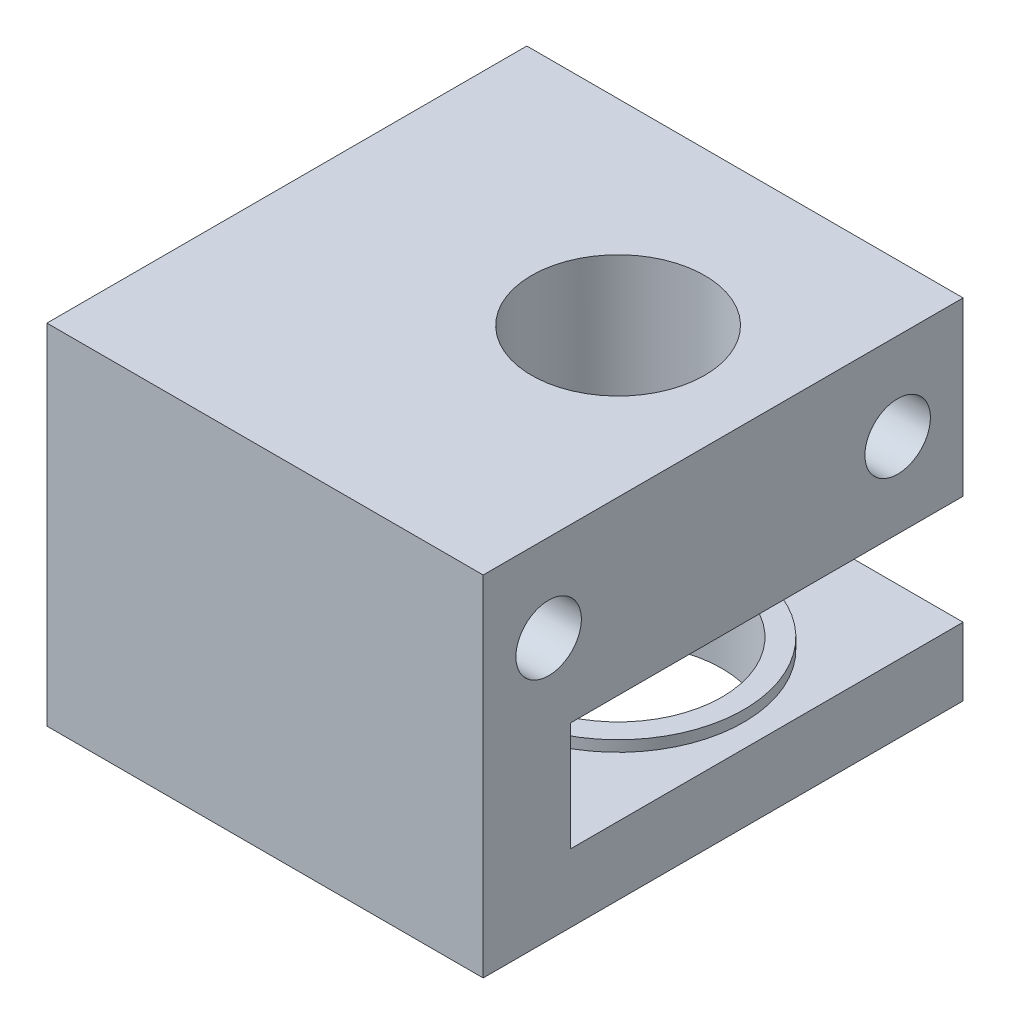
ISO-10303-21;
HEADER;
FILE_DESCRIPTION(('STEP AP214'),'2;1');
FILE_NAME('part.step','',(''),(''),'','','');
FILE_SCHEMA(('AUTOMOTIVE_DESIGN { 1 0 10303 214 1 1 1 1 }'));
ENDSEC;
DATA;
#1=APPLICATION_CONTEXT('core data for automotive mechanical design processes');
#2=APPLICATION_PROTOCOL_DEFINITION('international standard','automotive_design',2000,#1);
#3=PRODUCT_CONTEXT('',#1,'mechanical');
#4=PRODUCT('Part','Part','',(#3));
#5=PRODUCT_RELATED_PRODUCT_CATEGORY('part','',(#4));
#6=PRODUCT_DEFINITION_FORMATION('','',#4);
#7=PRODUCT_DEFINITION_CONTEXT('part definition',#1,'design');
#8=PRODUCT_DEFINITION('design','',#6,#7);
#9=PRODUCT_DEFINITION_SHAPE('','',#8);
#10=(LENGTH_UNIT() NAMED_UNIT(*) SI_UNIT(.MILLI.,.METRE.));
#11=(NAMED_UNIT(*) PLANE_ANGLE_UNIT() SI_UNIT($,.RADIAN.));
#12=(NAMED_UNIT(*) SI_UNIT($,.STERADIAN.) SOLID_ANGLE_UNIT());
#13=UNCERTAINTY_MEASURE_WITH_UNIT(LENGTH_MEASURE(1.E-05),#10,'distance_accuracy_value','');
#14=(GEOMETRIC_REPRESENTATION_CONTEXT(3) GLOBAL_UNCERTAINTY_ASSIGNED_CONTEXT((#13)) GLOBAL_UNIT_ASSIGNED_CONTEXT((#10,
#11,#12)) REPRESENTATION_CONTEXT('',''));
#15=CARTESIAN_POINT('',(0.,0.,0.));
#16=DIRECTION('',(0.,0.,1.));
#17=DIRECTION('',(1.,0.,0.));
#18=AXIS2_PLACEMENT_3D('',#15,#16,#17);
#19=CARTESIAN_POINT('',(20.,8.125,0.));
#20=DIRECTION('',(0.,1.,0.));
#21=DIRECTION('',(0.,0.,1.));
#22=AXIS2_PLACEMENT_3D('',#19,#20,#21);
#23=PLANE('',#22);
#24=CARTESIAN_POINT('',(13.1844941743299,8.125,-13.));
#25=DIRECTION('',(0.,1.,0.));
#26=DIRECTION('',(0.,0.,1.));
#27=AXIS2_PLACEMENT_3D('',#24,#25,#26);
#28=CIRCLE('',#27,5.2625);
#29=CARTESIAN_POINT('',(13.1844941743299,8.125,-7.7375));
#30=VERTEX_POINT('',#29);
#31=EDGE_CURVE('E48',#30,#30,#28,.F.);
#32=ORIENTED_EDGE('',*,*,#31,.F.);
#33=EDGE_LOOP('',(#32));
#34=FACE_BOUND('',#33,.T.);
#35=DIRECTION('',(1.,0.,0.));
#36=VECTOR('',#35,1.);
#37=CARTESIAN_POINT('',(20.,8.125,-4.));
#38=LINE('',#37,#36);
#39=CARTESIAN_POINT('',(5.,8.125,-4.));
#40=VERTEX_POINT('',#39);
#41=CARTESIAN_POINT('',(20.,8.125,-4.));
#42=VERTEX_POINT('',#41);
#43=EDGE_CURVE('E114',#40,#42,#38,.T.);
#44=ORIENTED_EDGE('',*,*,#43,.F.);
#45=DIRECTION('',(0.,0.,-1.));
#46=VECTOR('',#45,1.);
#47=CARTESIAN_POINT('',(5.,8.125,0.));
#48=LINE('',#47,#46);
#49=CARTESIAN_POINT('',(5.,8.125,-22.));
#50=VERTEX_POINT('',#49);
#51=EDGE_CURVE('E106',#40,#50,#48,.T.);
#52=ORIENTED_EDGE('',*,*,#51,.T.);
#53=DIRECTION('',(1.,0.,0.));
#54=VECTOR('',#53,1.);
#55=CARTESIAN_POINT('',(20.,8.125,-22.));
#56=LINE('',#55,#54);
#57=CARTESIAN_POINT('',(20.,8.125,-22.));
#58=VERTEX_POINT('',#57);
#59=EDGE_CURVE('E165',#50,#58,#56,.T.);
#60=ORIENTED_EDGE('',*,*,#59,.T.);
#61=DIRECTION('',(0.,0.,-1.));
#62=VECTOR('',#61,1.);
#63=CARTESIAN_POINT('',(20.,8.125,0.));
#64=LINE('',#63,#62);
#65=EDGE_CURVE('E55',#42,#58,#64,.T.);
#66=ORIENTED_EDGE('',*,*,#65,.F.);
#67=EDGE_LOOP('',(#44,#52,#60,#66));
#68=FACE_BOUND('',#67,.T.);
#69=ADVANCED_FACE('F39',(#34,#68),#23,.F.);
#70=CARTESIAN_POINT('',(20.,3.125,0.));
#71=DIRECTION('',(0.,-1.,0.));
#72=DIRECTION('',(0.,0.,-1.));
#73=AXIS2_PLACEMENT_3D('',#70,#71,#72);
#74=PLANE('',#73);
#75=CARTESIAN_POINT('',(13.18449417433,3.125,-13.));
#76=DIRECTION('',(0.,-1.,0.));
#77=DIRECTION('',(0.,0.,-1.));
#78=AXIS2_PLACEMENT_3D('',#75,#76,#77);
#79=CIRCLE('',#78,5.7624999994069);
#80=CARTESIAN_POINT('',(13.18449417433,3.125,-18.7624999994069));
#81=VERTEX_POINT('',#80);
#82=EDGE_CURVE('E219',#81,#81,#79,.F.);
#83=ORIENTED_EDGE('',*,*,#82,.F.);
#84=EDGE_LOOP('',(#83));
#85=FACE_BOUND('',#84,.T.);
#86=DIRECTION('',(-1.,0.,0.));
#87=VECTOR('',#86,1.);
#88=CARTESIAN_POINT('',(5.,3.125,-4.));
#89=LINE('',#88,#87);
#90=CARTESIAN_POINT('',(20.,3.125,-4.));
#91=VERTEX_POINT('',#90);
#92=CARTESIAN_POINT('',(5.,3.125,-4.));
#93=VERTEX_POINT('',#92);
#94=EDGE_CURVE('E63',#91,#93,#89,.T.);
#95=ORIENTED_EDGE('',*,*,#94,.F.);
#96=DIRECTION('',(0.,0.,-1.));
#97=VECTOR('',#96,1.);
#98=CARTESIAN_POINT('',(20.,3.125,0.));
#99=LINE('',#98,#97);
#100=CARTESIAN_POINT('',(20.,3.125,-22.));
#101=VERTEX_POINT('',#100);
#102=EDGE_CURVE('E168',#91,#101,#99,.T.);
#103=ORIENTED_EDGE('',*,*,#102,.T.);
#104=DIRECTION('',(-1.,0.,0.));
#105=VECTOR('',#104,1.);
#106=CARTESIAN_POINT('',(20.,3.125,-22.));
#107=LINE('',#106,#105);
#108=CARTESIAN_POINT('',(5.,3.125,-22.));
#109=VERTEX_POINT('',#108);
#110=EDGE_CURVE('E159',#101,#109,#107,.T.);
#111=ORIENTED_EDGE('',*,*,#110,.T.);
#112=DIRECTION('',(0.,0.,-1.));
#113=VECTOR('',#112,1.);
#114=CARTESIAN_POINT('',(5.,3.125,0.));
#115=LINE('',#114,#113);
#116=EDGE_CURVE('E112',#93,#109,#115,.T.);
#117=ORIENTED_EDGE('',*,*,#116,.F.);
#118=EDGE_LOOP('',(#95,#103,#111,#117));
#119=FACE_BOUND('',#118,.T.);
#120=ADVANCED_FACE('F229',(#85,#119),#74,.F.);
#121=CARTESIAN_POINT('',(5.,3.125,0.));
#122=DIRECTION('',(-1.,0.,0.));
#123=DIRECTION('',(0.,0.,1.));
#124=AXIS2_PLACEMENT_3D('',#121,#122,#123);
#125=PLANE('',#124);
#126=DIRECTION('',(0.,1.,0.));
#127=VECTOR('',#126,1.);
#128=CARTESIAN_POINT('',(5.,3.125,-4.));
#129=LINE('',#128,#127);
#130=EDGE_CURVE('E11',#93,#40,#129,.T.);
#131=ORIENTED_EDGE('',*,*,#130,.F.);
#132=ORIENTED_EDGE('',*,*,#116,.T.);
#133=DIRECTION('',(0.,1.,0.));
#134=VECTOR('',#133,1.);
#135=CARTESIAN_POINT('',(5.,3.125,-22.));
#136=LINE('',#135,#134);
#137=EDGE_CURVE('E109',#109,#50,#136,.T.);
#138=ORIENTED_EDGE('',*,*,#137,.T.);
#139=ORIENTED_EDGE('',*,*,#51,.F.);
#140=EDGE_LOOP('',(#131,#132,#138,#139));
#141=FACE_BOUND('',#140,.T.);
#142=ADVANCED_FACE('F107',(#141),#125,.F.);
#143=CARTESIAN_POINT('',(0.,16.,0.));
#144=DIRECTION('',(1.,0.,0.));
#145=DIRECTION('',(0.,0.,-1.));
#146=AXIS2_PLACEMENT_3D('',#143,#144,#145);
#147=PLANE('',#146);
#148=CARTESIAN_POINT('',(0.,12.,-3.));
#149=DIRECTION('',(-1.,0.,0.));
#150=DIRECTION('',(0.,0.,1.));
#151=AXIS2_PLACEMENT_3D('',#148,#149,#150);
#152=CIRCLE('',#151,1.5);
#153=CARTESIAN_POINT('',(0.,12.,-1.5));
#154=VERTEX_POINT('',#153);
#155=EDGE_CURVE('E130',#154,#154,#152,.T.);
#156=ORIENTED_EDGE('',*,*,#155,.F.);
#157=EDGE_LOOP('',(#156));
#158=FACE_BOUND('',#157,.T.);
#159=CARTESIAN_POINT('',(0.,12.,-19.));
#160=DIRECTION('',(-1.,0.,0.));
#161=DIRECTION('',(0.,0.,1.));
#162=AXIS2_PLACEMENT_3D('',#159,#160,#161);
#163=CIRCLE('',#162,1.5);
#164=CARTESIAN_POINT('',(0.,12.,-17.5));
#165=VERTEX_POINT('',#164);
#166=EDGE_CURVE('E133',#165,#165,#163,.T.);
#167=ORIENTED_EDGE('',*,*,#166,.F.);
#168=EDGE_LOOP('',(#167));
#169=FACE_BOUND('',#168,.T.);
#170=DIRECTION('',(0.,0.,1.));
#171=VECTOR('',#170,1.);
#172=CARTESIAN_POINT('',(0.,0.,0.));
#173=LINE('',#172,#171);
#174=CARTESIAN_POINT('',(0.,0.,-22.));
#175=VERTEX_POINT('',#174);
#176=CARTESIAN_POINT('',(0.,0.,0.));
#177=VERTEX_POINT('',#176);
#178=EDGE_CURVE('E170',#175,#177,#173,.T.);
#179=ORIENTED_EDGE('',*,*,#178,.T.);
#180=DIRECTION('',(0.,-1.,0.));
#181=VECTOR('',#180,1.);
#182=CARTESIAN_POINT('',(0.,16.,0.));
#183=LINE('',#182,#181);
#184=CARTESIAN_POINT('',(0.,16.,0.));
#185=VERTEX_POINT('',#184);
#186=EDGE_CURVE('E215',#185,#177,#183,.T.);
#187=ORIENTED_EDGE('',*,*,#186,.F.);
#188=DIRECTION('',(0.,0.,1.));
#189=VECTOR('',#188,1.);
#190=CARTESIAN_POINT('',(0.,16.,0.));
#191=LINE('',#190,#189);
#192=CARTESIAN_POINT('',(0.,16.,-22.));
#193=VERTEX_POINT('',#192);
#194=EDGE_CURVE('E176',#193,#185,#191,.T.);
#195=ORIENTED_EDGE('',*,*,#194,.F.);
#196=DIRECTION('',(0.,-1.,0.));
#197=VECTOR('',#196,1.);
#198=CARTESIAN_POINT('',(0.,16.,-22.));
#199=LINE('',#198,#197);
#200=EDGE_CURVE('E190',#193,#175,#199,.T.);
#201=ORIENTED_EDGE('',*,*,#200,.T.);
#202=EDGE_LOOP('',(#179,#187,#195,#201));
#203=FACE_BOUND('',#202,.T.);
#204=ADVANCED_FACE('F41',(#158,#169,#203),#147,.F.);
#205=CARTESIAN_POINT('',(0.,16.,0.));
#206=DIRECTION('',(0.,0.,-1.));
#207=DIRECTION('',(-1.,0.,0.));
#208=AXIS2_PLACEMENT_3D('',#205,#206,#207);
#209=PLANE('',#208);
#210=DIRECTION('',(1.,0.,0.));
#211=VECTOR('',#210,1.);
#212=CARTESIAN_POINT('',(0.,0.,0.));
#213=LINE('',#212,#211);
#214=CARTESIAN_POINT('',(20.,0.,0.));
#215=VERTEX_POINT('',#214);
#216=EDGE_CURVE('E194',#177,#215,#213,.T.);
#217=ORIENTED_EDGE('',*,*,#216,.T.);
#218=DIRECTION('',(0.,-1.,0.));
#219=VECTOR('',#218,1.);
#220=CARTESIAN_POINT('',(20.,16.,0.));
#221=LINE('',#220,#219);
#222=CARTESIAN_POINT('',(20.,16.,0.));
#223=VERTEX_POINT('',#222);
#224=EDGE_CURVE('E212',#223,#215,#221,.T.);
#225=ORIENTED_EDGE('',*,*,#224,.F.);
#226=DIRECTION('',(1.,0.,0.));
#227=VECTOR('',#226,1.);
#228=CARTESIAN_POINT('',(0.,16.,0.));
#229=LINE('',#228,#227);
#230=EDGE_CURVE('E180',#185,#223,#229,.T.);
#231=ORIENTED_EDGE('',*,*,#230,.F.);
#232=ORIENTED_EDGE('',*,*,#186,.T.);
#233=EDGE_LOOP('',(#217,#225,#231,#232));
#234=FACE_BOUND('',#233,.T.);
#235=ADVANCED_FACE('F256',(#234),#209,.F.);
#236=CARTESIAN_POINT('',(20.,16.,0.));
#237=DIRECTION('',(-1.,0.,0.));
#238=DIRECTION('',(0.,0.,1.));
#239=AXIS2_PLACEMENT_3D('',#236,#237,#238);
#240=PLANE('',#239);
#241=CARTESIAN_POINT('',(20.,12.,-3.));
#242=DIRECTION('',(-1.,0.,0.));
#243=DIRECTION('',(0.,0.,1.));
#244=AXIS2_PLACEMENT_3D('',#241,#242,#243);
#245=CIRCLE('',#244,1.5);
#246=CARTESIAN_POINT('',(20.,12.,-1.5));
#247=VERTEX_POINT('',#246);
#248=EDGE_CURVE('E124',#247,#247,#245,.T.);
#249=ORIENTED_EDGE('',*,*,#248,.T.);
#250=EDGE_LOOP('',(#249));
#251=FACE_BOUND('',#250,.T.);
#252=CARTESIAN_POINT('',(20.,12.,-19.));
#253=DIRECTION('',(-1.,0.,0.));
#254=DIRECTION('',(0.,0.,1.));
#255=AXIS2_PLACEMENT_3D('',#252,#253,#254);
#256=CIRCLE('',#255,1.5);
#257=CARTESIAN_POINT('',(20.,12.,-17.5));
#258=VERTEX_POINT('',#257);
#259=EDGE_CURVE('E418',#258,#258,#256,.T.);
#260=ORIENTED_EDGE('',*,*,#259,.T.);
#261=EDGE_LOOP('',(#260));
#262=FACE_BOUND('',#261,.T.);
#263=DIRECTION('',(0.,-1.,0.));
#264=VECTOR('',#263,1.);
#265=CARTESIAN_POINT('',(20.,16.,-22.));
#266=LINE('',#265,#264);
#267=CARTESIAN_POINT('',(20.,0.,-22.));
#268=VERTEX_POINT('',#267);
#269=EDGE_CURVE('E207',#101,#268,#266,.T.);
#270=ORIENTED_EDGE('',*,*,#269,.F.);
#271=ORIENTED_EDGE('',*,*,#102,.F.);
#272=DIRECTION('',(0.,-1.,0.));
#273=VECTOR('',#272,1.);
#274=CARTESIAN_POINT('',(20.,16.,-4.));
#275=LINE('',#274,#273);
#276=EDGE_CURVE('E120',#42,#91,#275,.T.);
#277=ORIENTED_EDGE('',*,*,#276,.F.);
#278=ORIENTED_EDGE('',*,*,#65,.T.);
#279=CARTESIAN_POINT('',(20.,16.,-22.));
#280=VERTEX_POINT('',#279);
#281=EDGE_CURVE('E208',#280,#58,#266,.T.);
#282=ORIENTED_EDGE('',*,*,#281,.F.);
#283=DIRECTION('',(0.,0.,-1.));
#284=VECTOR('',#283,1.);
#285=CARTESIAN_POINT('',(20.,16.,0.));
#286=LINE('',#285,#284);
#287=EDGE_CURVE('E184',#223,#280,#286,.T.);
#288=ORIENTED_EDGE('',*,*,#287,.F.);
#289=ORIENTED_EDGE('',*,*,#224,.T.);
#290=DIRECTION('',(0.,0.,-1.));
#291=VECTOR('',#290,1.);
#292=CARTESIAN_POINT('',(20.,0.,0.));
#293=LINE('',#292,#291);
#294=EDGE_CURVE('E198',#215,#268,#293,.T.);
#295=ORIENTED_EDGE('',*,*,#294,.T.);
#296=EDGE_LOOP('',(#270,#271,#277,#278,#282,#288,#289,#295));
#297=FACE_BOUND('',#296,.T.);
#298=ADVANCED_FACE('F253',(#251,#262,#297),#240,.F.);
#299=CARTESIAN_POINT('',(0.,16.,-22.));
#300=DIRECTION('',(0.,0.,1.));
#301=DIRECTION('',(1.,0.,0.));
#302=AXIS2_PLACEMENT_3D('',#299,#300,#301);
#303=PLANE('',#302);
#304=ORIENTED_EDGE('',*,*,#281,.T.);
#305=ORIENTED_EDGE('',*,*,#59,.F.);
#306=ORIENTED_EDGE('',*,*,#137,.F.);
#307=ORIENTED_EDGE('',*,*,#110,.F.);
#308=ORIENTED_EDGE('',*,*,#269,.T.);
#309=DIRECTION('',(-1.,0.,0.));
#310=VECTOR('',#309,1.);
#311=CARTESIAN_POINT('',(0.,0.,-22.));
#312=LINE('',#311,#310);
#313=EDGE_CURVE('E181',#268,#175,#312,.T.);
#314=ORIENTED_EDGE('',*,*,#313,.T.);
#315=ORIENTED_EDGE('',*,*,#200,.F.);
#316=DIRECTION('',(-1.,0.,0.));
#317=VECTOR('',#316,1.);
#318=CARTESIAN_POINT('',(0.,16.,-22.));
#319=LINE('',#318,#317);
#320=EDGE_CURVE('E187',#280,#193,#319,.T.);
#321=ORIENTED_EDGE('',*,*,#320,.F.);
#322=EDGE_LOOP('',(#304,#305,#306,#307,#308,#314,#315,#321));
#323=FACE_BOUND('',#322,.T.);
#324=ADVANCED_FACE('F246',(#323),#303,.F.);
#325=CARTESIAN_POINT('',(0.,16.,0.));
#326=DIRECTION('',(0.,-1.,0.));
#327=DIRECTION('',(0.,0.,-1.));
#328=AXIS2_PLACEMENT_3D('',#325,#326,#327);
#329=PLANE('',#328);
#330=ORIENTED_EDGE('',*,*,#230,.T.);
#331=ORIENTED_EDGE('',*,*,#287,.T.);
#332=ORIENTED_EDGE('',*,*,#320,.T.);
#333=ORIENTED_EDGE('',*,*,#194,.T.);
#334=EDGE_LOOP('',(#330,#331,#332,#333));
#335=FACE_BOUND('',#334,.T.);
#336=CARTESIAN_POINT('',(13.1844941743299,16.,-13.));
#337=DIRECTION('',(0.,1.,0.));
#338=DIRECTION('',(-1.,0.,0.));
#339=AXIS2_PLACEMENT_3D('',#336,#337,#338);
#340=CIRCLE('',#339,3.96874999997526);
#341=CARTESIAN_POINT('',(9.21574417435468,16.,-13.));
#342=VERTEX_POINT('',#341);
#343=EDGE_CURVE('E155',#342,#342,#340,.T.);
#344=ORIENTED_EDGE('',*,*,#343,.F.);
#345=EDGE_LOOP('',(#344));
#346=FACE_BOUND('',#345,.T.);
#347=ADVANCED_FACE('F242',(#335,#346),#329,.F.);
#348=CARTESIAN_POINT('',(0.,0.,0.));
#349=DIRECTION('',(0.,-1.,0.));
#350=DIRECTION('',(0.,0.,-1.));
#351=AXIS2_PLACEMENT_3D('',#348,#349,#350);
#352=PLANE('',#351);
#353=CARTESIAN_POINT('',(13.18449417433,0.,-13.));
#354=DIRECTION('',(0.,-1.,0.));
#355=DIRECTION('',(0.,0.,-1.));
#356=AXIS2_PLACEMENT_3D('',#353,#354,#355);
#357=CIRCLE('',#356,4.76249999950437);
#358=CARTESIAN_POINT('',(13.18449417433,0.,-17.7624999995044));
#359=VERTEX_POINT('',#358);
#360=EDGE_CURVE('E151',#359,#359,#357,.T.);
#361=ORIENTED_EDGE('',*,*,#360,.F.);
#362=EDGE_LOOP('',(#361));
#363=FACE_BOUND('',#362,.T.);
#364=ORIENTED_EDGE('',*,*,#178,.F.);
#365=ORIENTED_EDGE('',*,*,#313,.F.);
#366=ORIENTED_EDGE('',*,*,#294,.F.);
#367=ORIENTED_EDGE('',*,*,#216,.F.);
#368=EDGE_LOOP('',(#364,#365,#366,#367));
#369=FACE_BOUND('',#368,.T.);
#370=ADVANCED_FACE('F245',(#363,#369),#352,.T.);
#371=CARTESIAN_POINT('',(13.1844941743299,0.,-13.));
#372=DIRECTION('',(0.,1.,0.));
#373=DIRECTION('',(-1.,0.,0.));
#374=AXIS2_PLACEMENT_3D('',#371,#372,#373);
#375=CYLINDRICAL_SURFACE('',#374,3.96874999997526);
#376=ORIENTED_EDGE('',*,*,#343,.T.);
#377=EDGE_LOOP('',(#376));
#378=FACE_BOUND('',#377,.T.);
#379=CARTESIAN_POINT('',(13.1844941743299,7.625,-13.));
#380=DIRECTION('',(0.,-1.,0.));
#381=DIRECTION('',(0.,0.,-1.));
#382=AXIS2_PLACEMENT_3D('',#379,#380,#381);
#383=CIRCLE('',#382,3.96874999997666);
#384=CARTESIAN_POINT('',(13.1844941743299,7.625,-16.9687499999767));
#385=VERTEX_POINT('',#384);
#386=EDGE_CURVE('E119',#385,#385,#383,.T.);
#387=ORIENTED_EDGE('',*,*,#386,.T.);
#388=EDGE_LOOP('',(#387));
#389=FACE_BOUND('',#388,.T.);
#390=ADVANCED_FACE('F238',(#378,#389),#375,.F.);
#391=CARTESIAN_POINT('',(13.18449417433,16.001,-13.));
#392=DIRECTION('',(0.,-1.,0.));
#393=DIRECTION('',(0.,0.,-1.));
#394=AXIS2_PLACEMENT_3D('',#391,#392,#393);
#395=CYLINDRICAL_SURFACE('',#394,4.76249999950437);
#396=ORIENTED_EDGE('',*,*,#360,.T.);
#397=EDGE_LOOP('',(#396));
#398=FACE_BOUND('',#397,.T.);
#399=CARTESIAN_POINT('',(13.18449417433,3.625,-13.));
#400=DIRECTION('',(0.,1.,0.));
#401=DIRECTION('',(0.,0.,1.));
#402=AXIS2_PLACEMENT_3D('',#399,#400,#401);
#403=CIRCLE('',#402,4.7624999994069);
#404=CARTESIAN_POINT('',(13.18449417433,3.625,-8.23750000059311));
#405=VERTEX_POINT('',#404);
#406=EDGE_CURVE('E143',#405,#405,#403,.T.);
#407=ORIENTED_EDGE('',*,*,#406,.T.);
#408=EDGE_LOOP('',(#407));
#409=FACE_BOUND('',#408,.T.);
#410=ADVANCED_FACE('F285',(#398,#409),#395,.F.);
#411=CARTESIAN_POINT('',(13.18449417433,3.625,-13.));
#412=DIRECTION('',(0.,1.,0.));
#413=DIRECTION('',(0.,0.,1.));
#414=AXIS2_PLACEMENT_3D('',#411,#412,#413);
#415=PLANE('',#414);
#416=CARTESIAN_POINT('',(13.18449417433,3.625,-13.));
#417=DIRECTION('',(0.,1.,0.));
#418=DIRECTION('',(0.,0.,1.));
#419=AXIS2_PLACEMENT_3D('',#416,#417,#418);
#420=CIRCLE('',#419,5.7624999994069);
#421=CARTESIAN_POINT('',(13.18449417433,3.625,-7.23750000059311));
#422=VERTEX_POINT('',#421);
#423=EDGE_CURVE('E147',#422,#422,#420,.T.);
#424=ORIENTED_EDGE('',*,*,#423,.T.);
#425=EDGE_LOOP('',(#424));
#426=FACE_BOUND('',#425,.T.);
#427=ORIENTED_EDGE('',*,*,#406,.F.);
#428=EDGE_LOOP('',(#427));
#429=FACE_BOUND('',#428,.T.);
#430=ADVANCED_FACE('F299',(#426,#429),#415,.T.);
#431=CARTESIAN_POINT('',(13.18449417433,3.625,-13.));
#432=DIRECTION('',(0.,-1.,0.));
#433=DIRECTION('',(0.,0.,-1.));
#434=AXIS2_PLACEMENT_3D('',#431,#432,#433);
#435=CYLINDRICAL_SURFACE('',#434,5.7624999994069);
#436=ORIENTED_EDGE('',*,*,#423,.F.);
#437=EDGE_LOOP('',(#436));
#438=FACE_BOUND('',#437,.T.);
#439=ORIENTED_EDGE('',*,*,#82,.T.);
#440=EDGE_LOOP('',(#439));
#441=FACE_BOUND('',#440,.T.);
#442=ADVANCED_FACE('F290',(#438,#441),#435,.T.);
#443=CARTESIAN_POINT('',(13.1844941743299,7.625,-13.));
#444=DIRECTION('',(0.,-1.,0.));
#445=DIRECTION('',(0.,0.,-1.));
#446=AXIS2_PLACEMENT_3D('',#443,#444,#445);
#447=PLANE('',#446);
#448=CARTESIAN_POINT('',(13.1844941743299,7.625,-13.));
#449=DIRECTION('',(0.,-1.,0.));
#450=DIRECTION('',(0.,0.,-1.));
#451=AXIS2_PLACEMENT_3D('',#448,#449,#450);
#452=CIRCLE('',#451,5.2625);
#453=CARTESIAN_POINT('',(13.1844941743299,7.625,-18.2625));
#454=VERTEX_POINT('',#453);
#455=EDGE_CURVE('E139',#454,#454,#452,.T.);
#456=ORIENTED_EDGE('',*,*,#455,.T.);
#457=EDGE_LOOP('',(#456));
#458=FACE_BOUND('',#457,.T.);
#459=ORIENTED_EDGE('',*,*,#386,.F.);
#460=EDGE_LOOP('',(#459));
#461=FACE_BOUND('',#460,.T.);
#462=ADVANCED_FACE('F288',(#458,#461),#447,.T.);
#463=CARTESIAN_POINT('',(13.1844941743299,7.625,-13.));
#464=DIRECTION('',(0.,1.,0.));
#465=DIRECTION('',(0.,0.,1.));
#466=AXIS2_PLACEMENT_3D('',#463,#464,#465);
#467=CYLINDRICAL_SURFACE('',#466,5.2625);
#468=ORIENTED_EDGE('',*,*,#455,.F.);
#469=EDGE_LOOP('',(#468));
#470=FACE_BOUND('',#469,.T.);
#471=ORIENTED_EDGE('',*,*,#31,.T.);
#472=EDGE_LOOP('',(#471));
#473=FACE_BOUND('',#472,.T.);
#474=ADVANCED_FACE('F226',(#470,#473),#467,.T.);
#475=CARTESIAN_POINT('',(5.,16.,-4.));
#476=DIRECTION('',(0.,0.,1.));
#477=DIRECTION('',(1.,0.,0.));
#478=AXIS2_PLACEMENT_3D('',#475,#476,#477);
#479=PLANE('',#478);
#480=ORIENTED_EDGE('',*,*,#130,.T.);
#481=ORIENTED_EDGE('',*,*,#43,.T.);
#482=ORIENTED_EDGE('',*,*,#276,.T.);
#483=ORIENTED_EDGE('',*,*,#94,.T.);
#484=EDGE_LOOP('',(#480,#481,#482,#483));
#485=FACE_BOUND('',#484,.T.);
#486=ADVANCED_FACE('F122',(#485),#479,.F.);
#487=CARTESIAN_POINT('',(20.,12.,-19.));
#488=DIRECTION('',(-1.,0.,0.));
#489=DIRECTION('',(0.,0.,1.));
#490=AXIS2_PLACEMENT_3D('',#487,#488,#489);
#491=CYLINDRICAL_SURFACE('',#490,1.5);
#492=ORIENTED_EDGE('',*,*,#259,.F.);
#493=EDGE_LOOP('',(#492));
#494=FACE_BOUND('',#493,.T.);
#495=ORIENTED_EDGE('',*,*,#166,.T.);
#496=EDGE_LOOP('',(#495));
#497=FACE_BOUND('',#496,.T.);
#498=ADVANCED_FACE('F380',(#494,#497),#491,.F.);
#499=CARTESIAN_POINT('',(20.,12.,-3.));
#500=DIRECTION('',(-1.,0.,0.));
#501=DIRECTION('',(0.,0.,1.));
#502=AXIS2_PLACEMENT_3D('',#499,#500,#501);
#503=CYLINDRICAL_SURFACE('',#502,1.5);
#504=ORIENTED_EDGE('',*,*,#248,.F.);
#505=EDGE_LOOP('',(#504));
#506=FACE_BOUND('',#505,.T.);
#507=ORIENTED_EDGE('',*,*,#155,.T.);
#508=EDGE_LOOP('',(#507));
#509=FACE_BOUND('',#508,.T.);
#510=ADVANCED_FACE('F400',(#506,#509),#503,.F.);
#511=CLOSED_SHELL('',(#69,#120,#142,#204,#235,#298,#324,#347,#370,#390,#410,#430,#442,#462,#474,
#486,#498,#510));
#512=MANIFOLD_SOLID_BREP('B2',#511);
#513=ADVANCED_BREP_SHAPE_REPRESENTATION('',(#18,#512),#14);
#514=SHAPE_DEFINITION_REPRESENTATION(#9,#513);
ENDSEC;
END-ISO-10303-21;
